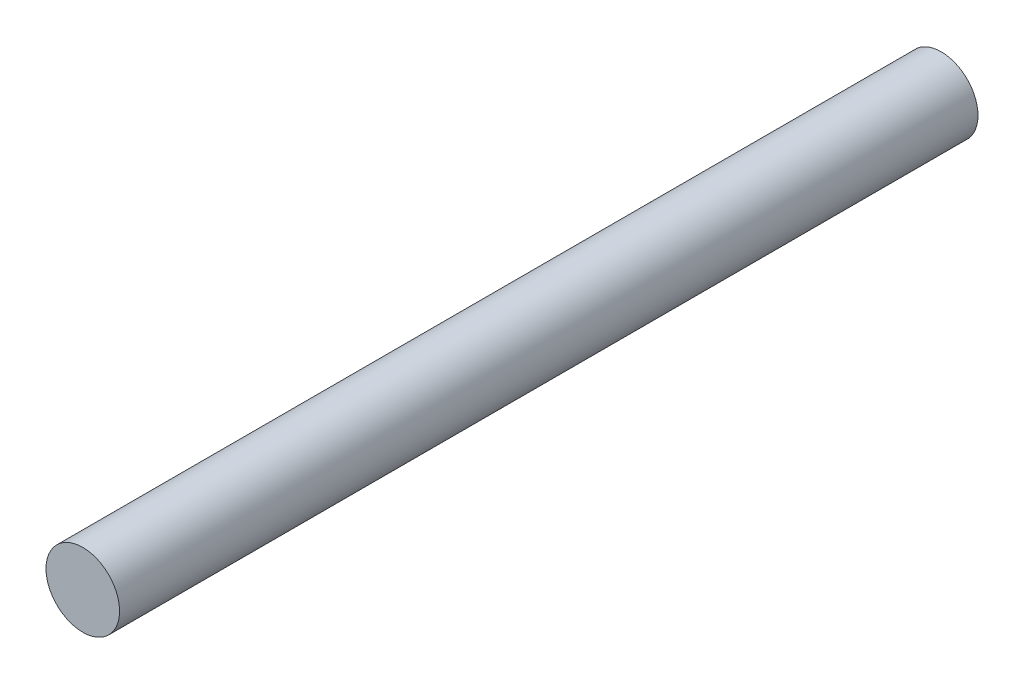
ISO-10303-21;
HEADER;
FILE_DESCRIPTION(('STEP AP214'),'2;1');
FILE_NAME('part.step','',(''),(''),'','','');
FILE_SCHEMA(('AUTOMOTIVE_DESIGN { 1 0 10303 214 1 1 1 1 }'));
ENDSEC;
DATA;
#1=APPLICATION_CONTEXT('core data for automotive mechanical design processes');
#2=APPLICATION_PROTOCOL_DEFINITION('international standard','automotive_design',2000,#1);
#3=PRODUCT_CONTEXT('',#1,'mechanical');
#4=PRODUCT('Part','Part','',(#3));
#5=PRODUCT_RELATED_PRODUCT_CATEGORY('part','',(#4));
#6=PRODUCT_DEFINITION_FORMATION('','',#4);
#7=PRODUCT_DEFINITION_CONTEXT('part definition',#1,'design');
#8=PRODUCT_DEFINITION('design','',#6,#7);
#9=PRODUCT_DEFINITION_SHAPE('','',#8);
#10=(LENGTH_UNIT() NAMED_UNIT(*) SI_UNIT(.MILLI.,.METRE.));
#11=(NAMED_UNIT(*) PLANE_ANGLE_UNIT() SI_UNIT($,.RADIAN.));
#12=(NAMED_UNIT(*) SI_UNIT($,.STERADIAN.) SOLID_ANGLE_UNIT());
#13=UNCERTAINTY_MEASURE_WITH_UNIT(LENGTH_MEASURE(1.E-05),#10,'distance_accuracy_value','');
#14=(GEOMETRIC_REPRESENTATION_CONTEXT(3) GLOBAL_UNCERTAINTY_ASSIGNED_CONTEXT((#13)) GLOBAL_UNIT_ASSIGNED_CONTEXT((#10,
#11,#12)) REPRESENTATION_CONTEXT('',''));
#15=CARTESIAN_POINT('',(0.,0.,0.));
#16=DIRECTION('',(0.,0.,1.));
#17=DIRECTION('',(1.,0.,0.));
#18=AXIS2_PLACEMENT_3D('',#15,#16,#17);
#19=CARTESIAN_POINT('',(-36.068,0.,-22.86));
#20=DIRECTION('',(0.,0.,1.));
#21=DIRECTION('',(1.,0.,0.));
#22=AXIS2_PLACEMENT_3D('',#19,#20,#21);
#23=PLANE('',#22);
#24=CARTESIAN_POINT('',(-36.068,0.,-22.86));
#25=DIRECTION('',(0.,0.,1.));
#26=DIRECTION('',(1.,0.,0.));
#27=AXIS2_PLACEMENT_3D('',#24,#25,#26);
#28=CIRCLE('',#27,6.35);
#29=CARTESIAN_POINT('',(-29.718,0.,-22.86));
#30=VERTEX_POINT('',#29);
#31=EDGE_CURVE('E51',#30,#30,#28,.T.);
#32=ORIENTED_EDGE('',*,*,#31,.F.);
#33=EDGE_LOOP('',(#32));
#34=FACE_BOUND('',#33,.T.);
#35=ADVANCED_FACE('F44',(#34),#23,.F.);
#36=CARTESIAN_POINT('',(-36.068,0.,143.299352242133));
#37=DIRECTION('',(0.,0.,-1.));
#38=DIRECTION('',(-1.,0.,0.));
#39=AXIS2_PLACEMENT_3D('',#36,#37,#38);
#40=CYLINDRICAL_SURFACE('',#39,6.35);
#41=CARTESIAN_POINT('',(-36.068,0.,125.338839999995));
#42=DIRECTION('',(0.,0.,-1.));
#43=DIRECTION('',(-1.,0.,0.));
#44=AXIS2_PLACEMENT_3D('',#41,#42,#43);
#45=CIRCLE('',#44,6.35);
#46=CARTESIAN_POINT('',(-42.418,0.,125.338839999995));
#47=VERTEX_POINT('',#46);
#48=EDGE_CURVE('E11',#47,#47,#45,.T.);
#49=ORIENTED_EDGE('',*,*,#48,.T.);
#50=EDGE_LOOP('',(#49));
#51=FACE_BOUND('',#50,.T.);
#52=ORIENTED_EDGE('',*,*,#31,.T.);
#53=EDGE_LOOP('',(#52));
#54=FACE_BOUND('',#53,.T.);
#55=ADVANCED_FACE('F46',(#51,#54),#40,.T.);
#56=CARTESIAN_POINT('',(0.,0.,125.338839999995));
#57=DIRECTION('',(0.,0.,-1.));
#58=DIRECTION('',(-1.,0.,0.));
#59=AXIS2_PLACEMENT_3D('',#56,#57,#58);
#60=PLANE('',#59);
#61=ORIENTED_EDGE('',*,*,#48,.F.);
#62=EDGE_LOOP('',(#61));
#63=FACE_BOUND('',#62,.T.);
#64=ADVANCED_FACE('F62',(#63),#60,.F.);
#65=CLOSED_SHELL('',(#35,#55,#64));
#66=MANIFOLD_SOLID_BREP('B2',#65);
#67=ADVANCED_BREP_SHAPE_REPRESENTATION('',(#18,#66),#14);
#68=SHAPE_DEFINITION_REPRESENTATION(#9,#67);
ENDSEC;
END-ISO-10303-21;
